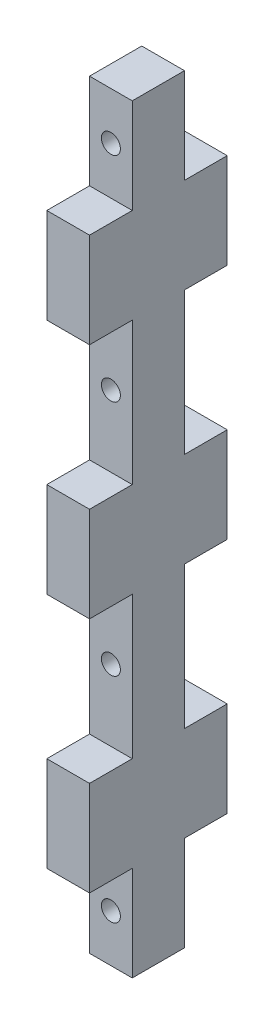
ISO-10303-21;
HEADER;
FILE_DESCRIPTION(('STEP AP214'),'2;1');
FILE_NAME('part.step','',(''),(''),'','','');
FILE_SCHEMA(('AUTOMOTIVE_DESIGN { 1 0 10303 214 1 1 1 1 }'));
ENDSEC;
DATA;
#1=APPLICATION_CONTEXT('core data for automotive mechanical design processes');
#2=APPLICATION_PROTOCOL_DEFINITION('international standard','automotive_design',2000,#1);
#3=PRODUCT_CONTEXT('',#1,'mechanical');
#4=PRODUCT('Part','Part','',(#3));
#5=PRODUCT_RELATED_PRODUCT_CATEGORY('part','',(#4));
#6=PRODUCT_DEFINITION_FORMATION('','',#4);
#7=PRODUCT_DEFINITION_CONTEXT('part definition',#1,'design');
#8=PRODUCT_DEFINITION('design','',#6,#7);
#9=PRODUCT_DEFINITION_SHAPE('','',#8);
#10=(LENGTH_UNIT() NAMED_UNIT(*) SI_UNIT(.MILLI.,.METRE.));
#11=(NAMED_UNIT(*) PLANE_ANGLE_UNIT() SI_UNIT($,.RADIAN.));
#12=(NAMED_UNIT(*) SI_UNIT($,.STERADIAN.) SOLID_ANGLE_UNIT());
#13=UNCERTAINTY_MEASURE_WITH_UNIT(LENGTH_MEASURE(1.E-05),#10,'distance_accuracy_value','');
#14=(GEOMETRIC_REPRESENTATION_CONTEXT(3) GLOBAL_UNCERTAINTY_ASSIGNED_CONTEXT((#13)) GLOBAL_UNIT_ASSIGNED_CONTEXT((#10,
#11,#12)) REPRESENTATION_CONTEXT('',''));
#15=CARTESIAN_POINT('',(0.,0.,0.));
#16=DIRECTION('',(0.,0.,1.));
#17=DIRECTION('',(1.,0.,0.));
#18=AXIS2_PLACEMENT_3D('',#15,#16,#17);
#19=CARTESIAN_POINT('',(0.,0.,20.));
#20=DIRECTION('',(0.,0.,-1.));
#21=DIRECTION('',(-1.,0.,0.));
#22=AXIS2_PLACEMENT_3D('',#19,#20,#21);
#23=PLANE('',#22);
#24=CARTESIAN_POINT('',(47.5,105.,20.));
#25=DIRECTION('',(0.,0.,1.));
#26=DIRECTION('',(1.,0.,0.));
#27=AXIS2_PLACEMENT_3D('',#24,#25,#26);
#28=CIRCLE('',#27,2.);
#29=CARTESIAN_POINT('',(49.5,105.,20.));
#30=VERTEX_POINT('',#29);
#31=EDGE_CURVE('E406',#30,#30,#28,.T.);
#32=ORIENTED_EDGE('',*,*,#31,.F.);
#33=EDGE_LOOP('',(#32));
#34=FACE_BOUND('',#33,.T.);
#35=DIRECTION('',(0.,1.,0.));
#36=VECTOR('',#35,1.);
#37=CARTESIAN_POINT('',(52.,0.,20.));
#38=LINE('',#37,#36);
#39=CARTESIAN_POINT('',(52.,90.,20.));
#40=VERTEX_POINT('',#39);
#41=CARTESIAN_POINT('',(52.,120.,20.));
#42=VERTEX_POINT('',#41);
#43=EDGE_CURVE('E428',#40,#42,#38,.T.);
#44=ORIENTED_EDGE('',*,*,#43,.T.);
#45=DIRECTION('',(-1.,0.,0.));
#46=VECTOR('',#45,1.);
#47=CARTESIAN_POINT('',(0.,120.,20.));
#48=LINE('',#47,#46);
#49=CARTESIAN_POINT('',(43.,120.,20.));
#50=VERTEX_POINT('',#49);
#51=EDGE_CURVE('E247',#42,#50,#48,.T.);
#52=ORIENTED_EDGE('',*,*,#51,.T.);
#53=DIRECTION('',(0.,1.,0.));
#54=VECTOR('',#53,1.);
#55=CARTESIAN_POINT('',(43.,0.,20.));
#56=LINE('',#55,#54);
#57=CARTESIAN_POINT('',(43.,90.,20.));
#58=VERTEX_POINT('',#57);
#59=EDGE_CURVE('E238',#58,#50,#56,.T.);
#60=ORIENTED_EDGE('',*,*,#59,.F.);
#61=DIRECTION('',(1.,0.,0.));
#62=VECTOR('',#61,1.);
#63=CARTESIAN_POINT('',(0.,90.,20.));
#64=LINE('',#63,#62);
#65=EDGE_CURVE('E60',#58,#40,#64,.T.);
#66=ORIENTED_EDGE('',*,*,#65,.T.);
#67=EDGE_LOOP('',(#44,#52,#60,#66));
#68=FACE_BOUND('',#67,.T.);
#69=ADVANCED_FACE('F35',(#34,#68),#23,.F.);
#70=CARTESIAN_POINT('',(47.5,60.,20.));
#71=DIRECTION('',(0.,0.,1.));
#72=DIRECTION('',(1.,0.,0.));
#73=AXIS2_PLACEMENT_3D('',#70,#71,#72);
#74=CIRCLE('',#73,2.);
#75=CARTESIAN_POINT('',(49.5,60.,20.));
#76=VERTEX_POINT('',#75);
#77=EDGE_CURVE('E388',#76,#76,#74,.T.);
#78=ORIENTED_EDGE('',*,*,#77,.F.);
#79=EDGE_LOOP('',(#78));
#80=FACE_BOUND('',#79,.T.);
#81=CARTESIAN_POINT('',(52.,50.,20.));
#82=VERTEX_POINT('',#81);
#83=CARTESIAN_POINT('',(52.,70.,20.));
#84=VERTEX_POINT('',#83);
#85=EDGE_CURVE('E425',#82,#84,#38,.T.);
#86=ORIENTED_EDGE('',*,*,#85,.T.);
#87=DIRECTION('',(-1.,0.,0.));
#88=VECTOR('',#87,1.);
#89=CARTESIAN_POINT('',(0.,70.,20.));
#90=LINE('',#89,#88);
#91=CARTESIAN_POINT('',(43.,70.,20.));
#92=VERTEX_POINT('',#91);
#93=EDGE_CURVE('E258',#84,#92,#90,.T.);
#94=ORIENTED_EDGE('',*,*,#93,.T.);
#95=CARTESIAN_POINT('',(43.,50.,20.));
#96=VERTEX_POINT('',#95);
#97=EDGE_CURVE('E417',#96,#92,#56,.T.);
#98=ORIENTED_EDGE('',*,*,#97,.F.);
#99=DIRECTION('',(-1.,0.,0.));
#100=VECTOR('',#99,1.);
#101=CARTESIAN_POINT('',(0.,50.,20.));
#102=LINE('',#101,#100);
#103=EDGE_CURVE('E412',#82,#96,#102,.T.);
#104=ORIENTED_EDGE('',*,*,#103,.F.);
#105=EDGE_LOOP('',(#86,#94,#98,#104));
#106=FACE_BOUND('',#105,.T.);
#107=ADVANCED_FACE('F523',(#80,#106),#23,.F.);
#108=CARTESIAN_POINT('',(47.5,200.,20.));
#109=DIRECTION('',(0.,0.,1.));
#110=DIRECTION('',(1.,0.,0.));
#111=AXIS2_PLACEMENT_3D('',#108,#109,#110);
#112=CIRCLE('',#111,2.);
#113=CARTESIAN_POINT('',(49.5,200.,20.));
#114=VERTEX_POINT('',#113);
#115=EDGE_CURVE('E394',#114,#114,#112,.T.);
#116=ORIENTED_EDGE('',*,*,#115,.F.);
#117=EDGE_LOOP('',(#116));
#118=FACE_BOUND('',#117,.T.);
#119=CARTESIAN_POINT('',(43.,190.,20.));
#120=VERTEX_POINT('',#119);
#121=CARTESIAN_POINT('',(43.,210.,20.));
#122=VERTEX_POINT('',#121);
#123=EDGE_CURVE('E415',#120,#122,#56,.T.);
#124=ORIENTED_EDGE('',*,*,#123,.F.);
#125=DIRECTION('',(1.,0.,0.));
#126=VECTOR('',#125,1.);
#127=CARTESIAN_POINT('',(0.,190.,20.));
#128=LINE('',#127,#126);
#129=CARTESIAN_POINT('',(52.,190.,20.));
#130=VERTEX_POINT('',#129);
#131=EDGE_CURVE('E282',#120,#130,#128,.T.);
#132=ORIENTED_EDGE('',*,*,#131,.T.);
#133=CARTESIAN_POINT('',(52.,210.,20.));
#134=VERTEX_POINT('',#133);
#135=EDGE_CURVE('E424',#130,#134,#38,.T.);
#136=ORIENTED_EDGE('',*,*,#135,.T.);
#137=DIRECTION('',(-1.,0.,0.));
#138=VECTOR('',#137,1.);
#139=CARTESIAN_POINT('',(0.,210.,20.));
#140=LINE('',#139,#138);
#141=EDGE_CURVE('E420',#134,#122,#140,.T.);
#142=ORIENTED_EDGE('',*,*,#141,.T.);
#143=EDGE_LOOP('',(#124,#132,#136,#142));
#144=FACE_BOUND('',#143,.T.);
#145=ADVANCED_FACE('F530',(#118,#144),#23,.F.);
#146=CARTESIAN_POINT('',(0.,0.,9.));
#147=DIRECTION('',(0.,0.,-1.));
#148=DIRECTION('',(-1.,0.,0.));
#149=AXIS2_PLACEMENT_3D('',#146,#147,#148);
#150=PLANE('',#149);
#151=DIRECTION('',(1.,0.,0.));
#152=VECTOR('',#151,1.);
#153=CARTESIAN_POINT('',(0.,70.,9.));
#154=LINE('',#153,#152);
#155=CARTESIAN_POINT('',(43.,70.,9.));
#156=VERTEX_POINT('',#155);
#157=CARTESIAN_POINT('',(52.,70.,9.));
#158=VERTEX_POINT('',#157);
#159=EDGE_CURVE('E311',#156,#158,#154,.T.);
#160=ORIENTED_EDGE('',*,*,#159,.T.);
#161=DIRECTION('',(0.,1.,0.));
#162=VECTOR('',#161,1.);
#163=CARTESIAN_POINT('',(52.,0.,9.));
#164=LINE('',#163,#162);
#165=CARTESIAN_POINT('',(52.,50.,9.));
#166=VERTEX_POINT('',#165);
#167=EDGE_CURVE('E416',#166,#158,#164,.T.);
#168=ORIENTED_EDGE('',*,*,#167,.F.);
#169=DIRECTION('',(-1.,0.,0.));
#170=VECTOR('',#169,1.);
#171=CARTESIAN_POINT('',(0.,50.,9.));
#172=LINE('',#171,#170);
#173=CARTESIAN_POINT('',(43.,50.,9.));
#174=VERTEX_POINT('',#173);
#175=EDGE_CURVE('E409',#166,#174,#172,.T.);
#176=ORIENTED_EDGE('',*,*,#175,.T.);
#177=DIRECTION('',(0.,1.,0.));
#178=VECTOR('',#177,1.);
#179=CARTESIAN_POINT('',(43.,0.,9.));
#180=LINE('',#179,#178);
#181=EDGE_CURVE('E433',#174,#156,#180,.T.);
#182=ORIENTED_EDGE('',*,*,#181,.T.);
#183=EDGE_LOOP('',(#160,#168,#176,#182));
#184=FACE_BOUND('',#183,.T.);
#185=CARTESIAN_POINT('',(47.5,60.,9.));
#186=DIRECTION('',(0.,0.,1.));
#187=DIRECTION('',(1.,0.,0.));
#188=AXIS2_PLACEMENT_3D('',#185,#186,#187);
#189=CIRCLE('',#188,2.);
#190=CARTESIAN_POINT('',(49.5,60.,9.));
#191=VERTEX_POINT('',#190);
#192=EDGE_CURVE('E387',#191,#191,#189,.T.);
#193=ORIENTED_EDGE('',*,*,#192,.T.);
#194=EDGE_LOOP('',(#193));
#195=FACE_BOUND('',#194,.T.);
#196=ADVANCED_FACE('F457',(#184,#195),#150,.T.);
#197=DIRECTION('',(-1.,0.,0.));
#198=VECTOR('',#197,1.);
#199=CARTESIAN_POINT('',(0.,90.,9.));
#200=LINE('',#199,#198);
#201=CARTESIAN_POINT('',(52.,90.,9.));
#202=VERTEX_POINT('',#201);
#203=CARTESIAN_POINT('',(43.,90.,9.));
#204=VERTEX_POINT('',#203);
#205=EDGE_CURVE('E313',#202,#204,#200,.T.);
#206=ORIENTED_EDGE('',*,*,#205,.T.);
#207=CARTESIAN_POINT('',(43.,120.,9.));
#208=VERTEX_POINT('',#207);
#209=EDGE_CURVE('E436',#204,#208,#180,.T.);
#210=ORIENTED_EDGE('',*,*,#209,.T.);
#211=DIRECTION('',(1.,0.,0.));
#212=VECTOR('',#211,1.);
#213=CARTESIAN_POINT('',(0.,120.,9.));
#214=LINE('',#213,#212);
#215=CARTESIAN_POINT('',(52.,120.,9.));
#216=VERTEX_POINT('',#215);
#217=EDGE_CURVE('E339',#208,#216,#214,.T.);
#218=ORIENTED_EDGE('',*,*,#217,.T.);
#219=EDGE_CURVE('E441',#202,#216,#164,.T.);
#220=ORIENTED_EDGE('',*,*,#219,.F.);
#221=EDGE_LOOP('',(#206,#210,#218,#220));
#222=FACE_BOUND('',#221,.T.);
#223=CARTESIAN_POINT('',(47.5,105.,9.));
#224=DIRECTION('',(0.,0.,1.));
#225=DIRECTION('',(1.,0.,0.));
#226=AXIS2_PLACEMENT_3D('',#223,#224,#225);
#227=CIRCLE('',#226,2.);
#228=CARTESIAN_POINT('',(49.5,105.,9.));
#229=VERTEX_POINT('',#228);
#230=EDGE_CURVE('E403',#229,#229,#227,.T.);
#231=ORIENTED_EDGE('',*,*,#230,.T.);
#232=EDGE_LOOP('',(#231));
#233=FACE_BOUND('',#232,.T.);
#234=ADVANCED_FACE('F476',(#222,#233),#150,.T.);
#235=CARTESIAN_POINT('',(47.5,200.,9.));
#236=DIRECTION('',(0.,0.,1.));
#237=DIRECTION('',(1.,0.,0.));
#238=AXIS2_PLACEMENT_3D('',#235,#236,#237);
#239=CIRCLE('',#238,2.);
#240=CARTESIAN_POINT('',(49.5,200.,9.));
#241=VERTEX_POINT('',#240);
#242=EDGE_CURVE('E391',#241,#241,#239,.T.);
#243=ORIENTED_EDGE('',*,*,#242,.T.);
#244=EDGE_LOOP('',(#243));
#245=FACE_BOUND('',#244,.T.);
#246=CARTESIAN_POINT('',(52.,190.,9.));
#247=VERTEX_POINT('',#246);
#248=CARTESIAN_POINT('',(52.,210.,9.));
#249=VERTEX_POINT('',#248);
#250=EDGE_CURVE('E439',#247,#249,#164,.T.);
#251=ORIENTED_EDGE('',*,*,#250,.F.);
#252=DIRECTION('',(-1.,0.,0.));
#253=VECTOR('',#252,1.);
#254=CARTESIAN_POINT('',(0.,190.,9.));
#255=LINE('',#254,#253);
#256=CARTESIAN_POINT('',(43.,190.,9.));
#257=VERTEX_POINT('',#256);
#258=EDGE_CURVE('E362',#247,#257,#255,.T.);
#259=ORIENTED_EDGE('',*,*,#258,.T.);
#260=CARTESIAN_POINT('',(43.,210.,9.));
#261=VERTEX_POINT('',#260);
#262=EDGE_CURVE('E432',#257,#261,#180,.T.);
#263=ORIENTED_EDGE('',*,*,#262,.T.);
#264=DIRECTION('',(-1.,0.,0.));
#265=VECTOR('',#264,1.);
#266=CARTESIAN_POINT('',(0.,210.,9.));
#267=LINE('',#266,#265);
#268=EDGE_CURVE('E435',#249,#261,#267,.T.);
#269=ORIENTED_EDGE('',*,*,#268,.F.);
#270=EDGE_LOOP('',(#251,#259,#263,#269));
#271=FACE_BOUND('',#270,.T.);
#272=ADVANCED_FACE('F493',(#245,#271),#150,.T.);
#273=DIRECTION('',(-1.,0.,0.));
#274=VECTOR('',#273,1.);
#275=CARTESIAN_POINT('',(0.,140.,9.));
#276=LINE('',#275,#274);
#277=CARTESIAN_POINT('',(52.,140.,9.));
#278=VERTEX_POINT('',#277);
#279=CARTESIAN_POINT('',(43.,140.,9.00000000000001));
#280=VERTEX_POINT('',#279);
#281=EDGE_CURVE('E336',#278,#280,#276,.T.);
#282=ORIENTED_EDGE('',*,*,#281,.T.);
#283=CARTESIAN_POINT('',(43.,170.,9.00000000000001));
#284=VERTEX_POINT('',#283);
#285=EDGE_CURVE('E494',#280,#284,#180,.T.);
#286=ORIENTED_EDGE('',*,*,#285,.T.);
#287=DIRECTION('',(1.,0.,0.));
#288=VECTOR('',#287,1.);
#289=CARTESIAN_POINT('',(0.,170.,9.));
#290=LINE('',#289,#288);
#291=CARTESIAN_POINT('',(52.,170.,9.));
#292=VERTEX_POINT('',#291);
#293=EDGE_CURVE('E365',#284,#292,#290,.T.);
#294=ORIENTED_EDGE('',*,*,#293,.T.);
#295=EDGE_CURVE('E480',#278,#292,#164,.T.);
#296=ORIENTED_EDGE('',*,*,#295,.F.);
#297=EDGE_LOOP('',(#282,#286,#294,#296));
#298=FACE_BOUND('',#297,.T.);
#299=CARTESIAN_POINT('',(47.5,155.,9.));
#300=DIRECTION('',(0.,0.,1.));
#301=DIRECTION('',(1.,0.,0.));
#302=AXIS2_PLACEMENT_3D('',#299,#300,#301);
#303=CIRCLE('',#302,2.);
#304=CARTESIAN_POINT('',(49.5,155.,9.));
#305=VERTEX_POINT('',#304);
#306=EDGE_CURVE('E397',#305,#305,#303,.T.);
#307=ORIENTED_EDGE('',*,*,#306,.T.);
#308=EDGE_LOOP('',(#307));
#309=FACE_BOUND('',#308,.T.);
#310=ADVANCED_FACE('F497',(#298,#309),#150,.T.);
#311=CARTESIAN_POINT('',(43.,140.,20.));
#312=VERTEX_POINT('',#311);
#313=CARTESIAN_POINT('',(43.,170.,20.));
#314=VERTEX_POINT('',#313);
#315=EDGE_CURVE('E421',#312,#314,#56,.T.);
#316=ORIENTED_EDGE('',*,*,#315,.F.);
#317=DIRECTION('',(1.,0.,0.));
#318=VECTOR('',#317,1.);
#319=CARTESIAN_POINT('',(0.,140.,20.));
#320=LINE('',#319,#318);
#321=CARTESIAN_POINT('',(52.,140.,20.));
#322=VERTEX_POINT('',#321);
#323=EDGE_CURVE('E52',#312,#322,#320,.T.);
#324=ORIENTED_EDGE('',*,*,#323,.T.);
#325=CARTESIAN_POINT('',(52.,170.,20.));
#326=VERTEX_POINT('',#325);
#327=EDGE_CURVE('E429',#322,#326,#38,.T.);
#328=ORIENTED_EDGE('',*,*,#327,.T.);
#329=DIRECTION('',(-1.,0.,0.));
#330=VECTOR('',#329,1.);
#331=CARTESIAN_POINT('',(0.,170.,20.));
#332=LINE('',#331,#330);
#333=EDGE_CURVE('E283',#326,#314,#332,.T.);
#334=ORIENTED_EDGE('',*,*,#333,.T.);
#335=EDGE_LOOP('',(#316,#324,#328,#334));
#336=FACE_BOUND('',#335,.T.);
#337=CARTESIAN_POINT('',(47.5,155.,20.));
#338=DIRECTION('',(0.,0.,1.));
#339=DIRECTION('',(1.,0.,0.));
#340=AXIS2_PLACEMENT_3D('',#337,#338,#339);
#341=CIRCLE('',#340,2.);
#342=CARTESIAN_POINT('',(49.5,155.,20.));
#343=VERTEX_POINT('',#342);
#344=EDGE_CURVE('E400',#343,#343,#341,.T.);
#345=ORIENTED_EDGE('',*,*,#344,.F.);
#346=EDGE_LOOP('',(#345));
#347=FACE_BOUND('',#346,.T.);
#348=ADVANCED_FACE('F526',(#336,#347),#23,.F.);
#349=CARTESIAN_POINT('',(0.,50.,20.));
#350=DIRECTION('',(0.,-1.,0.));
#351=DIRECTION('',(0.,0.,-1.));
#352=AXIS2_PLACEMENT_3D('',#349,#350,#351);
#353=PLANE('',#352);
#354=ORIENTED_EDGE('',*,*,#175,.F.);
#355=DIRECTION('',(0.,0.,-1.));
#356=VECTOR('',#355,1.);
#357=CARTESIAN_POINT('',(52.,50.,20.));
#358=LINE('',#357,#356);
#359=EDGE_CURVE('E11',#82,#166,#358,.T.);
#360=ORIENTED_EDGE('',*,*,#359,.F.);
#361=ORIENTED_EDGE('',*,*,#103,.T.);
#362=DIRECTION('',(0.,0.,-1.));
#363=VECTOR('',#362,1.);
#364=CARTESIAN_POINT('',(43.,50.,20.));
#365=LINE('',#364,#363);
#366=EDGE_CURVE('E39',#96,#174,#365,.T.);
#367=ORIENTED_EDGE('',*,*,#366,.T.);
#368=EDGE_LOOP('',(#354,#360,#361,#367));
#369=FACE_BOUND('',#368,.T.);
#370=ADVANCED_FACE('F37',(#369),#353,.T.);
#371=CARTESIAN_POINT('',(52.,0.,20.));
#372=DIRECTION('',(-1.,0.,0.));
#373=DIRECTION('',(0.,0.,1.));
#374=AXIS2_PLACEMENT_3D('',#371,#372,#373);
#375=PLANE('',#374);
#376=ORIENTED_EDGE('',*,*,#167,.T.);
#377=DIRECTION('',(0.,0.,-1.));
#378=VECTOR('',#377,1.);
#379=CARTESIAN_POINT('',(52.,70.,30.9317121994613));
#380=LINE('',#379,#378);
#381=CARTESIAN_POINT('',(52.,70.,0.));
#382=VERTEX_POINT('',#381);
#383=EDGE_CURVE('E330',#158,#382,#380,.T.);
#384=ORIENTED_EDGE('',*,*,#383,.T.);
#385=DIRECTION('',(0.,-1.,0.));
#386=VECTOR('',#385,1.);
#387=CARTESIAN_POINT('',(52.,0.,0.));
#388=LINE('',#387,#386);
#389=CARTESIAN_POINT('',(52.,90.,0.));
#390=VERTEX_POINT('',#389);
#391=EDGE_CURVE('E320',#390,#382,#388,.T.);
#392=ORIENTED_EDGE('',*,*,#391,.F.);
#393=DIRECTION('',(0.,0.,-1.));
#394=VECTOR('',#393,1.);
#395=CARTESIAN_POINT('',(52.,90.,30.9317121994613));
#396=LINE('',#395,#394);
#397=EDGE_CURVE('E328',#202,#390,#396,.T.);
#398=ORIENTED_EDGE('',*,*,#397,.F.);
#399=ORIENTED_EDGE('',*,*,#219,.T.);
#400=DIRECTION('',(0.,0.,-1.));
#401=VECTOR('',#400,1.);
#402=CARTESIAN_POINT('',(52.,120.,30.9317121994613));
#403=LINE('',#402,#401);
#404=CARTESIAN_POINT('',(52.,120.,0.));
#405=VERTEX_POINT('',#404);
#406=EDGE_CURVE('E340',#216,#405,#403,.T.);
#407=ORIENTED_EDGE('',*,*,#406,.T.);
#408=DIRECTION('',(0.,-1.,0.));
#409=VECTOR('',#408,1.);
#410=CARTESIAN_POINT('',(52.,0.,0.));
#411=LINE('',#410,#409);
#412=CARTESIAN_POINT('',(52.,140.,0.));
#413=VERTEX_POINT('',#412);
#414=EDGE_CURVE('E346',#413,#405,#411,.T.);
#415=ORIENTED_EDGE('',*,*,#414,.F.);
#416=DIRECTION('',(0.,0.,-1.));
#417=VECTOR('',#416,1.);
#418=CARTESIAN_POINT('',(52.,140.,30.9317121994613));
#419=LINE('',#418,#417);
#420=EDGE_CURVE('E359',#278,#413,#419,.T.);
#421=ORIENTED_EDGE('',*,*,#420,.F.);
#422=ORIENTED_EDGE('',*,*,#295,.T.);
#423=DIRECTION('',(0.,0.,-1.));
#424=VECTOR('',#423,1.);
#425=CARTESIAN_POINT('',(52.,170.,30.9317121994613));
#426=LINE('',#425,#424);
#427=CARTESIAN_POINT('',(52.,170.,0.));
#428=VERTEX_POINT('',#427);
#429=EDGE_CURVE('E378',#292,#428,#426,.T.);
#430=ORIENTED_EDGE('',*,*,#429,.T.);
#431=DIRECTION('',(0.,-1.,0.));
#432=VECTOR('',#431,1.);
#433=CARTESIAN_POINT('',(52.,0.,0.));
#434=LINE('',#433,#432);
#435=CARTESIAN_POINT('',(52.,190.,0.));
#436=VERTEX_POINT('',#435);
#437=EDGE_CURVE('E343',#436,#428,#434,.T.);
#438=ORIENTED_EDGE('',*,*,#437,.F.);
#439=DIRECTION('',(0.,0.,-1.));
#440=VECTOR('',#439,1.);
#441=CARTESIAN_POINT('',(52.,190.,30.9317121994613));
#442=LINE('',#441,#440);
#443=EDGE_CURVE('E366',#247,#436,#442,.T.);
#444=ORIENTED_EDGE('',*,*,#443,.F.);
#445=ORIENTED_EDGE('',*,*,#250,.T.);
#446=DIRECTION('',(0.,0.,-1.));
#447=VECTOR('',#446,1.);
#448=CARTESIAN_POINT('',(52.,210.,20.));
#449=LINE('',#448,#447);
#450=EDGE_CURVE('E44',#134,#249,#449,.T.);
#451=ORIENTED_EDGE('',*,*,#450,.F.);
#452=ORIENTED_EDGE('',*,*,#135,.F.);
#453=DIRECTION('',(0.,0.,-1.));
#454=VECTOR('',#453,1.);
#455=CARTESIAN_POINT('',(52.,190.,50.9317121994613));
#456=LINE('',#455,#454);
#457=CARTESIAN_POINT('',(52.,190.,29.));
#458=VERTEX_POINT('',#457);
#459=EDGE_CURVE('E291',#458,#130,#456,.T.);
#460=ORIENTED_EDGE('',*,*,#459,.F.);
#461=DIRECTION('',(0.,-1.,0.));
#462=VECTOR('',#461,1.);
#463=CARTESIAN_POINT('',(52.,0.,29.));
#464=LINE('',#463,#462);
#465=CARTESIAN_POINT('',(52.,170.,29.));
#466=VERTEX_POINT('',#465);
#467=EDGE_CURVE('E301',#458,#466,#464,.T.);
#468=ORIENTED_EDGE('',*,*,#467,.T.);
#469=DIRECTION('',(0.,0.,-1.));
#470=VECTOR('',#469,1.);
#471=CARTESIAN_POINT('',(52.,170.,50.9317121994613));
#472=LINE('',#471,#470);
#473=EDGE_CURVE('E300',#466,#326,#472,.T.);
#474=ORIENTED_EDGE('',*,*,#473,.T.);
#475=ORIENTED_EDGE('',*,*,#327,.F.);
#476=DIRECTION('',(0.,0.,-1.));
#477=VECTOR('',#476,1.);
#478=CARTESIAN_POINT('',(52.,140.,50.9317121994613));
#479=LINE('',#478,#477);
#480=CARTESIAN_POINT('',(52.,140.,29.));
#481=VERTEX_POINT('',#480);
#482=EDGE_CURVE('E253',#481,#322,#479,.T.);
#483=ORIENTED_EDGE('',*,*,#482,.F.);
#484=DIRECTION('',(0.,-1.,0.));
#485=VECTOR('',#484,1.);
#486=CARTESIAN_POINT('',(52.,0.,29.));
#487=LINE('',#486,#485);
#488=CARTESIAN_POINT('',(52.,120.,29.));
#489=VERTEX_POINT('',#488);
#490=EDGE_CURVE('E251',#481,#489,#487,.T.);
#491=ORIENTED_EDGE('',*,*,#490,.T.);
#492=DIRECTION('',(0.,0.,-1.));
#493=VECTOR('',#492,1.);
#494=CARTESIAN_POINT('',(52.,120.,50.9317121994613));
#495=LINE('',#494,#493);
#496=EDGE_CURVE('E245',#489,#42,#495,.T.);
#497=ORIENTED_EDGE('',*,*,#496,.T.);
#498=ORIENTED_EDGE('',*,*,#43,.F.);
#499=DIRECTION('',(0.,0.,-1.));
#500=VECTOR('',#499,1.);
#501=CARTESIAN_POINT('',(52.,90.,50.9317121994613));
#502=LINE('',#501,#500);
#503=CARTESIAN_POINT('',(52.,90.,29.));
#504=VERTEX_POINT('',#503);
#505=EDGE_CURVE('E270',#504,#40,#502,.T.);
#506=ORIENTED_EDGE('',*,*,#505,.F.);
#507=DIRECTION('',(0.,-1.,0.));
#508=VECTOR('',#507,1.);
#509=CARTESIAN_POINT('',(52.,0.,29.));
#510=LINE('',#509,#508);
#511=CARTESIAN_POINT('',(52.,70.,29.));
#512=VERTEX_POINT('',#511);
#513=EDGE_CURVE('E266',#504,#512,#510,.T.);
#514=ORIENTED_EDGE('',*,*,#513,.T.);
#515=DIRECTION('',(0.,0.,-1.));
#516=VECTOR('',#515,1.);
#517=CARTESIAN_POINT('',(52.,70.,50.9317121994613));
#518=LINE('',#517,#516);
#519=EDGE_CURVE('E269',#512,#84,#518,.T.);
#520=ORIENTED_EDGE('',*,*,#519,.T.);
#521=ORIENTED_EDGE('',*,*,#85,.F.);
#522=ORIENTED_EDGE('',*,*,#359,.T.);
#523=EDGE_LOOP('',(#376,#384,#392,#398,#399,#407,#415,#421,#422,#430,#438,#444,#445,#451,#452,
#460,#468,#474,#475,#483,#491,#497,#498,#506,#514,#520,#521,#522));
#524=FACE_BOUND('',#523,.T.);
#525=ADVANCED_FACE('F461',(#524),#375,.F.);
#526=CARTESIAN_POINT('',(0.,210.,20.));
#527=DIRECTION('',(0.,-1.,0.));
#528=DIRECTION('',(0.,0.,-1.));
#529=AXIS2_PLACEMENT_3D('',#526,#527,#528);
#530=PLANE('',#529);
#531=ORIENTED_EDGE('',*,*,#268,.T.);
#532=DIRECTION('',(0.,0.,-1.));
#533=VECTOR('',#532,1.);
#534=CARTESIAN_POINT('',(43.,210.,20.));
#535=LINE('',#534,#533);
#536=EDGE_CURVE('E444',#122,#261,#535,.T.);
#537=ORIENTED_EDGE('',*,*,#536,.F.);
#538=ORIENTED_EDGE('',*,*,#141,.F.);
#539=ORIENTED_EDGE('',*,*,#450,.T.);
#540=EDGE_LOOP('',(#531,#537,#538,#539));
#541=FACE_BOUND('',#540,.T.);
#542=ADVANCED_FACE('F492',(#541),#530,.F.);
#543=CARTESIAN_POINT('',(43.,0.,20.));
#544=DIRECTION('',(-1.,0.,0.));
#545=DIRECTION('',(0.,0.,1.));
#546=AXIS2_PLACEMENT_3D('',#543,#544,#545);
#547=PLANE('',#546);
#548=ORIENTED_EDGE('',*,*,#181,.F.);
#549=ORIENTED_EDGE('',*,*,#366,.F.);
#550=ORIENTED_EDGE('',*,*,#97,.T.);
#551=DIRECTION('',(0.,0.,-1.));
#552=VECTOR('',#551,1.);
#553=CARTESIAN_POINT('',(43.,70.,50.9317121994613));
#554=LINE('',#553,#552);
#555=CARTESIAN_POINT('',(43.,70.,29.));
#556=VERTEX_POINT('',#555);
#557=EDGE_CURVE('E265',#556,#92,#554,.T.);
#558=ORIENTED_EDGE('',*,*,#557,.F.);
#559=DIRECTION('',(0.,1.,0.));
#560=VECTOR('',#559,1.);
#561=CARTESIAN_POINT('',(43.0000000000001,0.,29.));
#562=LINE('',#561,#560);
#563=CARTESIAN_POINT('',(43.,90.,29.));
#564=VERTEX_POINT('',#563);
#565=EDGE_CURVE('E275',#556,#564,#562,.T.);
#566=ORIENTED_EDGE('',*,*,#565,.T.);
#567=DIRECTION('',(0.,0.,-1.));
#568=VECTOR('',#567,1.);
#569=CARTESIAN_POINT('',(43.,90.,50.9317121994613));
#570=LINE('',#569,#568);
#571=EDGE_CURVE('E274',#564,#58,#570,.T.);
#572=ORIENTED_EDGE('',*,*,#571,.T.);
#573=ORIENTED_EDGE('',*,*,#59,.T.);
#574=DIRECTION('',(0.,0.,-1.));
#575=VECTOR('',#574,1.);
#576=CARTESIAN_POINT('',(43.,120.,50.9317121994613));
#577=LINE('',#576,#575);
#578=CARTESIAN_POINT('',(43.,120.,29.));
#579=VERTEX_POINT('',#578);
#580=EDGE_CURVE('E232',#579,#50,#577,.T.);
#581=ORIENTED_EDGE('',*,*,#580,.F.);
#582=DIRECTION('',(0.,1.,0.));
#583=VECTOR('',#582,1.);
#584=CARTESIAN_POINT('',(43.,0.,29.));
#585=LINE('',#584,#583);
#586=CARTESIAN_POINT('',(43.,140.,29.));
#587=VERTEX_POINT('',#586);
#588=EDGE_CURVE('E222',#579,#587,#585,.T.);
#589=ORIENTED_EDGE('',*,*,#588,.T.);
#590=DIRECTION('',(0.,0.,-1.));
#591=VECTOR('',#590,1.);
#592=CARTESIAN_POINT('',(43.,140.,50.9317121994613));
#593=LINE('',#592,#591);
#594=EDGE_CURVE('E231',#587,#312,#593,.T.);
#595=ORIENTED_EDGE('',*,*,#594,.T.);
#596=ORIENTED_EDGE('',*,*,#315,.T.);
#597=DIRECTION('',(0.,0.,-1.));
#598=VECTOR('',#597,1.);
#599=CARTESIAN_POINT('',(43.,170.,50.9317121994613));
#600=LINE('',#599,#598);
#601=CARTESIAN_POINT('',(43.,170.,29.));
#602=VERTEX_POINT('',#601);
#603=EDGE_CURVE('E296',#602,#314,#600,.T.);
#604=ORIENTED_EDGE('',*,*,#603,.F.);
#605=DIRECTION('',(0.,1.,0.));
#606=VECTOR('',#605,1.);
#607=CARTESIAN_POINT('',(43.,0.,29.));
#608=LINE('',#607,#606);
#609=CARTESIAN_POINT('',(43.,190.,29.));
#610=VERTEX_POINT('',#609);
#611=EDGE_CURVE('E292',#602,#610,#608,.T.);
#612=ORIENTED_EDGE('',*,*,#611,.T.);
#613=DIRECTION('',(0.,0.,-1.));
#614=VECTOR('',#613,1.);
#615=CARTESIAN_POINT('',(43.,190.,50.9317121994613));
#616=LINE('',#615,#614);
#617=EDGE_CURVE('E295',#610,#120,#616,.T.);
#618=ORIENTED_EDGE('',*,*,#617,.T.);
#619=ORIENTED_EDGE('',*,*,#123,.T.);
#620=ORIENTED_EDGE('',*,*,#536,.T.);
#621=ORIENTED_EDGE('',*,*,#262,.F.);
#622=DIRECTION('',(0.,0.,-1.));
#623=VECTOR('',#622,1.);
#624=CARTESIAN_POINT('',(43.,190.,30.9317121994613));
#625=LINE('',#624,#623);
#626=CARTESIAN_POINT('',(43.,190.,0.));
#627=VERTEX_POINT('',#626);
#628=EDGE_CURVE('E382',#257,#627,#625,.T.);
#629=ORIENTED_EDGE('',*,*,#628,.T.);
#630=DIRECTION('',(0.,1.,0.));
#631=VECTOR('',#630,1.);
#632=CARTESIAN_POINT('',(43.,0.,0.));
#633=LINE('',#632,#631);
#634=CARTESIAN_POINT('',(43.,170.,0.));
#635=VERTEX_POINT('',#634);
#636=EDGE_CURVE('E372',#635,#627,#633,.T.);
#637=ORIENTED_EDGE('',*,*,#636,.F.);
#638=DIRECTION('',(0.,0.,-1.));
#639=VECTOR('',#638,1.);
#640=CARTESIAN_POINT('',(43.,170.,30.9317121994613));
#641=LINE('',#640,#639);
#642=EDGE_CURVE('E380',#284,#635,#641,.T.);
#643=ORIENTED_EDGE('',*,*,#642,.F.);
#644=ORIENTED_EDGE('',*,*,#285,.F.);
#645=DIRECTION('',(0.,0.,-1.));
#646=VECTOR('',#645,1.);
#647=CARTESIAN_POINT('',(43.,140.,30.9317121994613));
#648=LINE('',#647,#646);
#649=CARTESIAN_POINT('',(43.,140.,0.));
#650=VERTEX_POINT('',#649);
#651=EDGE_CURVE('E357',#280,#650,#648,.T.);
#652=ORIENTED_EDGE('',*,*,#651,.T.);
#653=DIRECTION('',(0.,1.,0.));
#654=VECTOR('',#653,1.);
#655=CARTESIAN_POINT('',(43.,0.,0.));
#656=LINE('',#655,#654);
#657=CARTESIAN_POINT('',(43.,120.,0.));
#658=VERTEX_POINT('',#657);
#659=EDGE_CURVE('E352',#658,#650,#656,.T.);
#660=ORIENTED_EDGE('',*,*,#659,.F.);
#661=DIRECTION('',(0.,0.,-1.));
#662=VECTOR('',#661,1.);
#663=CARTESIAN_POINT('',(43.,120.,30.9317121994613));
#664=LINE('',#663,#662);
#665=EDGE_CURVE('E355',#208,#658,#664,.T.);
#666=ORIENTED_EDGE('',*,*,#665,.F.);
#667=ORIENTED_EDGE('',*,*,#209,.F.);
#668=DIRECTION('',(0.,0.,-1.));
#669=VECTOR('',#668,1.);
#670=CARTESIAN_POINT('',(43.,90.,30.9317121994613));
#671=LINE('',#670,#669);
#672=CARTESIAN_POINT('',(43.,90.,0.));
#673=VERTEX_POINT('',#672);
#674=EDGE_CURVE('E326',#204,#673,#671,.T.);
#675=ORIENTED_EDGE('',*,*,#674,.T.);
#676=DIRECTION('',(0.,1.,0.));
#677=VECTOR('',#676,1.);
#678=CARTESIAN_POINT('',(43.0000000000001,0.,0.));
#679=LINE('',#678,#677);
#680=CARTESIAN_POINT('',(43.,70.,0.));
#681=VERTEX_POINT('',#680);
#682=EDGE_CURVE('E310',#681,#673,#679,.T.);
#683=ORIENTED_EDGE('',*,*,#682,.F.);
#684=DIRECTION('',(0.,0.,-1.));
#685=VECTOR('',#684,1.);
#686=CARTESIAN_POINT('',(43.,70.,30.9317121994613));
#687=LINE('',#686,#685);
#688=EDGE_CURVE('E314',#156,#681,#687,.T.);
#689=ORIENTED_EDGE('',*,*,#688,.F.);
#690=EDGE_LOOP('',(#548,#549,#550,#558,#566,#572,#573,#581,#589,#595,#596,#604,#612,#618,#619,
#620,#621,#629,#637,#643,#644,#652,#660,#666,#667,#675,#683,#689));
#691=FACE_BOUND('',#690,.T.);
#692=ADVANCED_FACE('F236',(#691),#547,.T.);
#693=CARTESIAN_POINT('',(47.5,105.,20.));
#694=DIRECTION('',(0.,0.,-1.));
#695=DIRECTION('',(-1.,0.,0.));
#696=AXIS2_PLACEMENT_3D('',#693,#694,#695);
#697=CYLINDRICAL_SURFACE('',#696,2.);
#698=ORIENTED_EDGE('',*,*,#31,.T.);
#699=EDGE_LOOP('',(#698));
#700=FACE_BOUND('',#699,.T.);
#701=ORIENTED_EDGE('',*,*,#230,.F.);
#702=EDGE_LOOP('',(#701));
#703=FACE_BOUND('',#702,.T.);
#704=ADVANCED_FACE('F704',(#700,#703),#697,.F.);
#705=CARTESIAN_POINT('',(47.5,155.,20.));
#706=DIRECTION('',(0.,0.,-1.));
#707=DIRECTION('',(-1.,0.,0.));
#708=AXIS2_PLACEMENT_3D('',#705,#706,#707);
#709=CYLINDRICAL_SURFACE('',#708,2.);
#710=ORIENTED_EDGE('',*,*,#344,.T.);
#711=EDGE_LOOP('',(#710));
#712=FACE_BOUND('',#711,.T.);
#713=ORIENTED_EDGE('',*,*,#306,.F.);
#714=EDGE_LOOP('',(#713));
#715=FACE_BOUND('',#714,.T.);
#716=ADVANCED_FACE('F709',(#712,#715),#709,.F.);
#717=CARTESIAN_POINT('',(47.5,200.,20.));
#718=DIRECTION('',(0.,0.,-1.));
#719=DIRECTION('',(-1.,0.,0.));
#720=AXIS2_PLACEMENT_3D('',#717,#718,#719);
#721=CYLINDRICAL_SURFACE('',#720,2.);
#722=ORIENTED_EDGE('',*,*,#115,.T.);
#723=EDGE_LOOP('',(#722));
#724=FACE_BOUND('',#723,.T.);
#725=ORIENTED_EDGE('',*,*,#242,.F.);
#726=EDGE_LOOP('',(#725));
#727=FACE_BOUND('',#726,.T.);
#728=ADVANCED_FACE('F519',(#724,#727),#721,.F.);
#729=CARTESIAN_POINT('',(47.5,60.,20.));
#730=DIRECTION('',(0.,0.,-1.));
#731=DIRECTION('',(-1.,0.,0.));
#732=AXIS2_PLACEMENT_3D('',#729,#730,#731);
#733=CYLINDRICAL_SURFACE('',#732,2.);
#734=ORIENTED_EDGE('',*,*,#77,.T.);
#735=EDGE_LOOP('',(#734));
#736=FACE_BOUND('',#735,.T.);
#737=ORIENTED_EDGE('',*,*,#192,.F.);
#738=EDGE_LOOP('',(#737));
#739=FACE_BOUND('',#738,.T.);
#740=ADVANCED_FACE('F512',(#736,#739),#733,.F.);
#741=CARTESIAN_POINT('',(0.,190.,30.9317121994613));
#742=DIRECTION('',(0.,1.,0.));
#743=DIRECTION('',(0.,0.,1.));
#744=AXIS2_PLACEMENT_3D('',#741,#742,#743);
#745=PLANE('',#744);
#746=ORIENTED_EDGE('',*,*,#258,.F.);
#747=ORIENTED_EDGE('',*,*,#443,.T.);
#748=DIRECTION('',(1.,0.,0.));
#749=VECTOR('',#748,1.);
#750=CARTESIAN_POINT('',(0.,190.,0.));
#751=LINE('',#750,#749);
#752=EDGE_CURVE('E369',#627,#436,#751,.T.);
#753=ORIENTED_EDGE('',*,*,#752,.F.);
#754=ORIENTED_EDGE('',*,*,#628,.F.);
#755=EDGE_LOOP('',(#746,#747,#753,#754));
#756=FACE_BOUND('',#755,.T.);
#757=ADVANCED_FACE('F510',(#756),#745,.T.);
#758=CARTESIAN_POINT('',(0.,170.,30.9317121994613));
#759=DIRECTION('',(0.,-1.,0.));
#760=DIRECTION('',(0.,0.,-1.));
#761=AXIS2_PLACEMENT_3D('',#758,#759,#760);
#762=PLANE('',#761);
#763=ORIENTED_EDGE('',*,*,#293,.F.);
#764=ORIENTED_EDGE('',*,*,#642,.T.);
#765=DIRECTION('',(-1.,0.,0.));
#766=VECTOR('',#765,1.);
#767=CARTESIAN_POINT('',(0.,170.,0.));
#768=LINE('',#767,#766);
#769=EDGE_CURVE('E375',#428,#635,#768,.T.);
#770=ORIENTED_EDGE('',*,*,#769,.F.);
#771=ORIENTED_EDGE('',*,*,#429,.F.);
#772=EDGE_LOOP('',(#763,#764,#770,#771));
#773=FACE_BOUND('',#772,.T.);
#774=ADVANCED_FACE('F505',(#773),#762,.T.);
#775=CARTESIAN_POINT('',(0.,0.,0.));
#776=DIRECTION('',(0.,0.,1.));
#777=DIRECTION('',(1.,0.,0.));
#778=AXIS2_PLACEMENT_3D('',#775,#776,#777);
#779=PLANE('',#778);
#780=ORIENTED_EDGE('',*,*,#437,.T.);
#781=ORIENTED_EDGE('',*,*,#769,.T.);
#782=ORIENTED_EDGE('',*,*,#636,.T.);
#783=ORIENTED_EDGE('',*,*,#752,.T.);
#784=EDGE_LOOP('',(#780,#781,#782,#783));
#785=FACE_BOUND('',#784,.T.);
#786=ADVANCED_FACE('F507',(#785),#779,.F.);
#787=CARTESIAN_POINT('',(0.,120.,30.9317121994613));
#788=DIRECTION('',(0.,-1.,0.));
#789=DIRECTION('',(0.,0.,-1.));
#790=AXIS2_PLACEMENT_3D('',#787,#788,#789);
#791=PLANE('',#790);
#792=ORIENTED_EDGE('',*,*,#217,.F.);
#793=ORIENTED_EDGE('',*,*,#665,.T.);
#794=DIRECTION('',(-1.,0.,0.));
#795=VECTOR('',#794,1.);
#796=CARTESIAN_POINT('',(0.,120.,0.));
#797=LINE('',#796,#795);
#798=EDGE_CURVE('E335',#405,#658,#797,.T.);
#799=ORIENTED_EDGE('',*,*,#798,.F.);
#800=ORIENTED_EDGE('',*,*,#406,.F.);
#801=EDGE_LOOP('',(#792,#793,#799,#800));
#802=FACE_BOUND('',#801,.T.);
#803=ADVANCED_FACE('F590',(#802),#791,.T.);
#804=CARTESIAN_POINT('',(0.,140.,30.9317121994613));
#805=DIRECTION('',(0.,1.,0.));
#806=DIRECTION('',(0.,0.,1.));
#807=AXIS2_PLACEMENT_3D('',#804,#805,#806);
#808=PLANE('',#807);
#809=ORIENTED_EDGE('',*,*,#281,.F.);
#810=ORIENTED_EDGE('',*,*,#420,.T.);
#811=DIRECTION('',(1.,0.,0.));
#812=VECTOR('',#811,1.);
#813=CARTESIAN_POINT('',(0.,140.,0.));
#814=LINE('',#813,#812);
#815=EDGE_CURVE('E349',#650,#413,#814,.T.);
#816=ORIENTED_EDGE('',*,*,#815,.F.);
#817=ORIENTED_EDGE('',*,*,#651,.F.);
#818=EDGE_LOOP('',(#809,#810,#816,#817));
#819=FACE_BOUND('',#818,.T.);
#820=ADVANCED_FACE('F586',(#819),#808,.T.);
#821=CARTESIAN_POINT('',(0.,0.,0.));
#822=DIRECTION('',(0.,0.,1.));
#823=DIRECTION('',(1.,0.,0.));
#824=AXIS2_PLACEMENT_3D('',#821,#822,#823);
#825=PLANE('',#824);
#826=ORIENTED_EDGE('',*,*,#798,.T.);
#827=ORIENTED_EDGE('',*,*,#659,.T.);
#828=ORIENTED_EDGE('',*,*,#815,.T.);
#829=ORIENTED_EDGE('',*,*,#414,.T.);
#830=EDGE_LOOP('',(#826,#827,#828,#829));
#831=FACE_BOUND('',#830,.T.);
#832=ADVANCED_FACE('F583',(#831),#825,.F.);
#833=CARTESIAN_POINT('',(0.,70.,30.9317121994613));
#834=DIRECTION('',(0.,-1.,0.));
#835=DIRECTION('',(0.,0.,-1.));
#836=AXIS2_PLACEMENT_3D('',#833,#834,#835);
#837=PLANE('',#836);
#838=ORIENTED_EDGE('',*,*,#159,.F.);
#839=ORIENTED_EDGE('',*,*,#688,.T.);
#840=DIRECTION('',(-1.,0.,0.));
#841=VECTOR('',#840,1.);
#842=CARTESIAN_POINT('',(0.,70.,0.));
#843=LINE('',#842,#841);
#844=EDGE_CURVE('E317',#382,#681,#843,.T.);
#845=ORIENTED_EDGE('',*,*,#844,.F.);
#846=ORIENTED_EDGE('',*,*,#383,.F.);
#847=EDGE_LOOP('',(#838,#839,#845,#846));
#848=FACE_BOUND('',#847,.T.);
#849=ADVANCED_FACE('F466',(#848),#837,.T.);
#850=CARTESIAN_POINT('',(0.,90.,30.9317121994613));
#851=DIRECTION('',(0.,1.,0.));
#852=DIRECTION('',(0.,0.,1.));
#853=AXIS2_PLACEMENT_3D('',#850,#851,#852);
#854=PLANE('',#853);
#855=ORIENTED_EDGE('',*,*,#205,.F.);
#856=ORIENTED_EDGE('',*,*,#397,.T.);
#857=DIRECTION('',(1.,0.,0.));
#858=VECTOR('',#857,1.);
#859=CARTESIAN_POINT('',(0.,90.,0.));
#860=LINE('',#859,#858);
#861=EDGE_CURVE('E323',#673,#390,#860,.T.);
#862=ORIENTED_EDGE('',*,*,#861,.F.);
#863=ORIENTED_EDGE('',*,*,#674,.F.);
#864=EDGE_LOOP('',(#855,#856,#862,#863));
#865=FACE_BOUND('',#864,.T.);
#866=ADVANCED_FACE('F474',(#865),#854,.T.);
#867=CARTESIAN_POINT('',(0.,0.,0.));
#868=DIRECTION('',(0.,0.,1.));
#869=DIRECTION('',(1.,0.,0.));
#870=AXIS2_PLACEMENT_3D('',#867,#868,#869);
#871=PLANE('',#870);
#872=ORIENTED_EDGE('',*,*,#682,.T.);
#873=ORIENTED_EDGE('',*,*,#861,.T.);
#874=ORIENTED_EDGE('',*,*,#391,.T.);
#875=ORIENTED_EDGE('',*,*,#844,.T.);
#876=EDGE_LOOP('',(#872,#873,#874,#875));
#877=FACE_BOUND('',#876,.T.);
#878=ADVANCED_FACE('F468',(#877),#871,.F.);
#879=CARTESIAN_POINT('',(0.,0.,29.));
#880=DIRECTION('',(0.,0.,1.));
#881=DIRECTION('',(1.,0.,0.));
#882=AXIS2_PLACEMENT_3D('',#879,#880,#881);
#883=PLANE('',#882);
#884=ORIENTED_EDGE('',*,*,#611,.F.);
#885=DIRECTION('',(-1.,0.,0.));
#886=VECTOR('',#885,1.);
#887=CARTESIAN_POINT('',(0.,170.,29.));
#888=LINE('',#887,#886);
#889=EDGE_CURVE('E297',#466,#602,#888,.T.);
#890=ORIENTED_EDGE('',*,*,#889,.F.);
#891=ORIENTED_EDGE('',*,*,#467,.F.);
#892=DIRECTION('',(1.,0.,0.));
#893=VECTOR('',#892,1.);
#894=CARTESIAN_POINT('',(0.,190.,29.));
#895=LINE('',#894,#893);
#896=EDGE_CURVE('E286',#610,#458,#895,.T.);
#897=ORIENTED_EDGE('',*,*,#896,.F.);
#898=EDGE_LOOP('',(#884,#890,#891,#897));
#899=FACE_BOUND('',#898,.T.);
#900=ADVANCED_FACE('F562',(#899),#883,.T.);
#901=CARTESIAN_POINT('',(0.,190.,50.9317121994613));
#902=DIRECTION('',(0.,1.,0.));
#903=DIRECTION('',(0.,0.,1.));
#904=AXIS2_PLACEMENT_3D('',#901,#902,#903);
#905=PLANE('',#904);
#906=ORIENTED_EDGE('',*,*,#617,.F.);
#907=ORIENTED_EDGE('',*,*,#896,.T.);
#908=ORIENTED_EDGE('',*,*,#459,.T.);
#909=ORIENTED_EDGE('',*,*,#131,.F.);
#910=EDGE_LOOP('',(#906,#907,#908,#909));
#911=FACE_BOUND('',#910,.T.);
#912=ADVANCED_FACE('F565',(#911),#905,.T.);
#913=CARTESIAN_POINT('',(0.,170.,50.9317121994613));
#914=DIRECTION('',(0.,-1.,0.));
#915=DIRECTION('',(0.,0.,-1.));
#916=AXIS2_PLACEMENT_3D('',#913,#914,#915);
#917=PLANE('',#916);
#918=ORIENTED_EDGE('',*,*,#473,.F.);
#919=ORIENTED_EDGE('',*,*,#889,.T.);
#920=ORIENTED_EDGE('',*,*,#603,.T.);
#921=ORIENTED_EDGE('',*,*,#333,.F.);
#922=EDGE_LOOP('',(#918,#919,#920,#921));
#923=FACE_BOUND('',#922,.T.);
#924=ADVANCED_FACE('F557',(#923),#917,.T.);
#925=CARTESIAN_POINT('',(0.,0.,29.));
#926=DIRECTION('',(0.,0.,1.));
#927=DIRECTION('',(1.,0.,0.));
#928=AXIS2_PLACEMENT_3D('',#925,#926,#927);
#929=PLANE('',#928);
#930=ORIENTED_EDGE('',*,*,#513,.F.);
#931=DIRECTION('',(1.,0.,0.));
#932=VECTOR('',#931,1.);
#933=CARTESIAN_POINT('',(0.,90.,29.));
#934=LINE('',#933,#932);
#935=EDGE_CURVE('E271',#564,#504,#934,.T.);
#936=ORIENTED_EDGE('',*,*,#935,.F.);
#937=ORIENTED_EDGE('',*,*,#565,.F.);
#938=DIRECTION('',(-1.,0.,0.));
#939=VECTOR('',#938,1.);
#940=CARTESIAN_POINT('',(0.,70.,29.));
#941=LINE('',#940,#939);
#942=EDGE_CURVE('E260',#512,#556,#941,.T.);
#943=ORIENTED_EDGE('',*,*,#942,.F.);
#944=EDGE_LOOP('',(#930,#936,#937,#943));
#945=FACE_BOUND('',#944,.T.);
#946=ADVANCED_FACE('F572',(#945),#929,.T.);
#947=CARTESIAN_POINT('',(0.,70.,50.9317121994613));
#948=DIRECTION('',(0.,-1.,0.));
#949=DIRECTION('',(0.,0.,-1.));
#950=AXIS2_PLACEMENT_3D('',#947,#948,#949);
#951=PLANE('',#950);
#952=ORIENTED_EDGE('',*,*,#519,.F.);
#953=ORIENTED_EDGE('',*,*,#942,.T.);
#954=ORIENTED_EDGE('',*,*,#557,.T.);
#955=ORIENTED_EDGE('',*,*,#93,.F.);
#956=EDGE_LOOP('',(#952,#953,#954,#955));
#957=FACE_BOUND('',#956,.T.);
#958=ADVANCED_FACE('F656',(#957),#951,.T.);
#959=CARTESIAN_POINT('',(0.,90.,50.9317121994613));
#960=DIRECTION('',(0.,1.,0.));
#961=DIRECTION('',(0.,0.,1.));
#962=AXIS2_PLACEMENT_3D('',#959,#960,#961);
#963=PLANE('',#962);
#964=ORIENTED_EDGE('',*,*,#571,.F.);
#965=ORIENTED_EDGE('',*,*,#935,.T.);
#966=ORIENTED_EDGE('',*,*,#505,.T.);
#967=ORIENTED_EDGE('',*,*,#65,.F.);
#968=EDGE_LOOP('',(#964,#965,#966,#967));
#969=FACE_BOUND('',#968,.T.);
#970=ADVANCED_FACE('F666',(#969),#963,.T.);
#971=CARTESIAN_POINT('',(0.,0.,29.));
#972=DIRECTION('',(0.,0.,1.));
#973=DIRECTION('',(1.,0.,0.));
#974=AXIS2_PLACEMENT_3D('',#971,#972,#973);
#975=PLANE('',#974);
#976=ORIENTED_EDGE('',*,*,#490,.F.);
#977=DIRECTION('',(1.,0.,0.));
#978=VECTOR('',#977,1.);
#979=CARTESIAN_POINT('',(0.,140.,29.));
#980=LINE('',#979,#978);
#981=EDGE_CURVE('E229',#587,#481,#980,.T.);
#982=ORIENTED_EDGE('',*,*,#981,.F.);
#983=ORIENTED_EDGE('',*,*,#588,.F.);
#984=DIRECTION('',(-1.,0.,0.));
#985=VECTOR('',#984,1.);
#986=CARTESIAN_POINT('',(0.,120.,29.));
#987=LINE('',#986,#985);
#988=EDGE_CURVE('E226',#489,#579,#987,.T.);
#989=ORIENTED_EDGE('',*,*,#988,.F.);
#990=EDGE_LOOP('',(#976,#982,#983,#989));
#991=FACE_BOUND('',#990,.T.);
#992=ADVANCED_FACE('F224',(#991),#975,.T.);
#993=CARTESIAN_POINT('',(0.,120.,50.9317121994613));
#994=DIRECTION('',(0.,-1.,0.));
#995=DIRECTION('',(0.,0.,-1.));
#996=AXIS2_PLACEMENT_3D('',#993,#994,#995);
#997=PLANE('',#996);
#998=ORIENTED_EDGE('',*,*,#496,.F.);
#999=ORIENTED_EDGE('',*,*,#988,.T.);
#1000=ORIENTED_EDGE('',*,*,#580,.T.);
#1001=ORIENTED_EDGE('',*,*,#51,.F.);
#1002=EDGE_LOOP('',(#998,#999,#1000,#1001));
#1003=FACE_BOUND('',#1002,.T.);
#1004=ADVANCED_FACE('F244',(#1003),#997,.T.);
#1005=CARTESIAN_POINT('',(0.,140.,50.9317121994613));
#1006=DIRECTION('',(0.,1.,0.));
#1007=DIRECTION('',(0.,0.,1.));
#1008=AXIS2_PLACEMENT_3D('',#1005,#1006,#1007);
#1009=PLANE('',#1008);
#1010=ORIENTED_EDGE('',*,*,#594,.F.);
#1011=ORIENTED_EDGE('',*,*,#981,.T.);
#1012=ORIENTED_EDGE('',*,*,#482,.T.);
#1013=ORIENTED_EDGE('',*,*,#323,.F.);
#1014=EDGE_LOOP('',(#1010,#1011,#1012,#1013));
#1015=FACE_BOUND('',#1014,.T.);
#1016=ADVANCED_FACE('F692',(#1015),#1009,.T.);
#1017=CLOSED_SHELL('',(#69,#107,#145,#196,#234,#272,#310,#348,#370,#525,#542,#692,#704,#716,
#728,#740,#757,#774,#786,#803,#820,#832,#849,#866,#878,#900,#912,#924,#946,#958,#970,#992,#1004,#1016));
#1018=MANIFOLD_SOLID_BREP('B2',#1017);
#1019=ADVANCED_BREP_SHAPE_REPRESENTATION('',(#18,#1018),#14);
#1020=SHAPE_DEFINITION_REPRESENTATION(#9,#1019);
ENDSEC;
END-ISO-10303-21;
